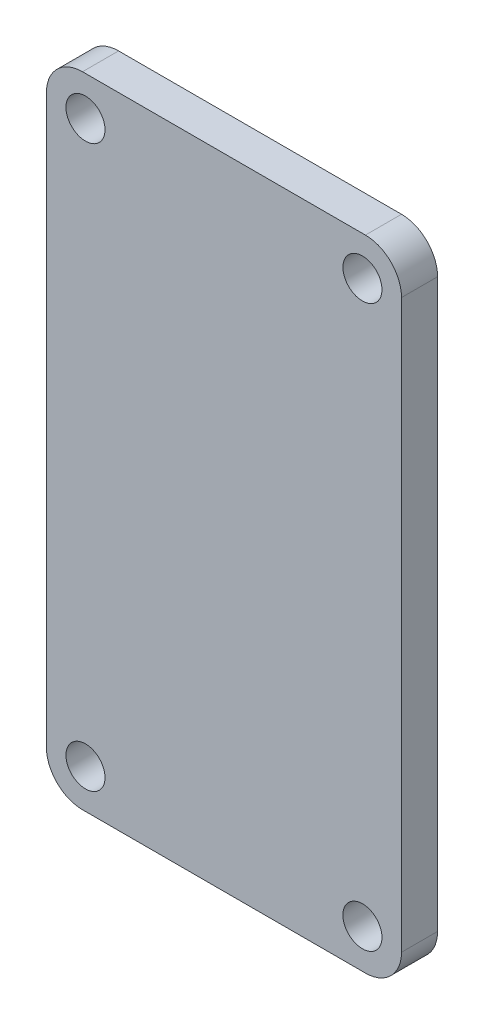
ISO-10303-21;
HEADER;
FILE_DESCRIPTION(('STEP AP214'),'2;1');
FILE_NAME('part.step','',(''),(''),'','','');
FILE_SCHEMA(('AUTOMOTIVE_DESIGN { 1 0 10303 214 1 1 1 1 }'));
ENDSEC;
DATA;
#1=APPLICATION_CONTEXT('core data for automotive mechanical design processes');
#2=APPLICATION_PROTOCOL_DEFINITION('international standard','automotive_design',2000,#1);
#3=PRODUCT_CONTEXT('',#1,'mechanical');
#4=PRODUCT('Part','Part','',(#3));
#5=PRODUCT_RELATED_PRODUCT_CATEGORY('part','',(#4));
#6=PRODUCT_DEFINITION_FORMATION('','',#4);
#7=PRODUCT_DEFINITION_CONTEXT('part definition',#1,'design');
#8=PRODUCT_DEFINITION('design','',#6,#7);
#9=PRODUCT_DEFINITION_SHAPE('','',#8);
#10=(LENGTH_UNIT() NAMED_UNIT(*) SI_UNIT(.MILLI.,.METRE.));
#11=(NAMED_UNIT(*) PLANE_ANGLE_UNIT() SI_UNIT($,.RADIAN.));
#12=(NAMED_UNIT(*) SI_UNIT($,.STERADIAN.) SOLID_ANGLE_UNIT());
#13=UNCERTAINTY_MEASURE_WITH_UNIT(LENGTH_MEASURE(1.E-05),#10,'distance_accuracy_value','');
#14=(GEOMETRIC_REPRESENTATION_CONTEXT(3) GLOBAL_UNCERTAINTY_ASSIGNED_CONTEXT((#13)) GLOBAL_UNIT_ASSIGNED_CONTEXT((#10,
#11,#12)) REPRESENTATION_CONTEXT('',''));
#15=CARTESIAN_POINT('',(0.,0.,0.));
#16=DIRECTION('',(0.,0.,1.));
#17=DIRECTION('',(1.,0.,0.));
#18=AXIS2_PLACEMENT_3D('',#15,#16,#17);
#19=CARTESIAN_POINT('',(0.,0.,2.54));
#20=DIRECTION('',(0.,0.,1.));
#21=DIRECTION('',(1.,0.,0.));
#22=AXIS2_PLACEMENT_3D('',#19,#20,#21);
#23=PLANE('',#22);
#24=CARTESIAN_POINT('',(22.25,-42.25,2.54));
#25=DIRECTION('',(0.,0.,1.));
#26=DIRECTION('',(1.,0.,0.));
#27=AXIS2_PLACEMENT_3D('',#24,#25,#26);
#28=CIRCLE('',#27,1.375);
#29=CARTESIAN_POINT('',(23.625,-42.25,2.54));
#30=VERTEX_POINT('',#29);
#31=EDGE_CURVE('E193',#30,#30,#28,.T.);
#32=ORIENTED_EDGE('',*,*,#31,.F.);
#33=EDGE_LOOP('',(#32));
#34=FACE_BOUND('',#33,.T.);
#35=CARTESIAN_POINT('',(2.75,-2.75,2.54));
#36=DIRECTION('',(0.,0.,1.));
#37=DIRECTION('',(1.,0.,0.));
#38=AXIS2_PLACEMENT_3D('',#35,#36,#37);
#39=CIRCLE('',#38,1.375);
#40=CARTESIAN_POINT('',(4.125,-2.75,2.54));
#41=VERTEX_POINT('',#40);
#42=EDGE_CURVE('E176',#41,#41,#39,.T.);
#43=ORIENTED_EDGE('',*,*,#42,.F.);
#44=EDGE_LOOP('',(#43));
#45=FACE_BOUND('',#44,.T.);
#46=DIRECTION('',(0.,1.,0.));
#47=VECTOR('',#46,1.);
#48=CARTESIAN_POINT('',(25.,0.,2.54));
#49=LINE('',#48,#47);
#50=CARTESIAN_POINT('',(25.,-42.46,2.54));
#51=VERTEX_POINT('',#50);
#52=CARTESIAN_POINT('',(25.,-2.54,2.54));
#53=VERTEX_POINT('',#52);
#54=EDGE_CURVE('E183',#51,#53,#49,.T.);
#55=ORIENTED_EDGE('',*,*,#54,.T.);
#56=CARTESIAN_POINT('',(22.46,-2.54,2.54));
#57=DIRECTION('',(0.,0.,1.));
#58=DIRECTION('',(1.,0.,0.));
#59=AXIS2_PLACEMENT_3D('',#56,#57,#58);
#60=CIRCLE('',#59,2.54);
#61=CARTESIAN_POINT('',(22.46,0.,2.54));
#62=VERTEX_POINT('',#61);
#63=EDGE_CURVE('E160',#53,#62,#60,.T.);
#64=ORIENTED_EDGE('',*,*,#63,.T.);
#65=DIRECTION('',(-1.,0.,0.));
#66=VECTOR('',#65,1.);
#67=CARTESIAN_POINT('',(0.,0.,2.54));
#68=LINE('',#67,#66);
#69=CARTESIAN_POINT('',(2.54,0.,2.54));
#70=VERTEX_POINT('',#69);
#71=EDGE_CURVE('E131',#62,#70,#68,.T.);
#72=ORIENTED_EDGE('',*,*,#71,.T.);
#73=CARTESIAN_POINT('',(2.54,-2.54,2.54));
#74=DIRECTION('',(0.,0.,1.));
#75=DIRECTION('',(1.,0.,0.));
#76=AXIS2_PLACEMENT_3D('',#73,#74,#75);
#77=CIRCLE('',#76,2.54);
#78=CARTESIAN_POINT('',(0.,-2.54,2.54));
#79=VERTEX_POINT('',#78);
#80=EDGE_CURVE('E155',#70,#79,#77,.T.);
#81=ORIENTED_EDGE('',*,*,#80,.T.);
#82=DIRECTION('',(0.,-1.,0.));
#83=VECTOR('',#82,1.);
#84=CARTESIAN_POINT('',(0.,0.,2.54));
#85=LINE('',#84,#83);
#86=CARTESIAN_POINT('',(0.,-42.46,2.54));
#87=VERTEX_POINT('',#86);
#88=EDGE_CURVE('E138',#79,#87,#85,.T.);
#89=ORIENTED_EDGE('',*,*,#88,.T.);
#90=CARTESIAN_POINT('',(2.54000000000001,-42.46,2.54));
#91=DIRECTION('',(0.,0.,1.));
#92=DIRECTION('',(1.,0.,0.));
#93=AXIS2_PLACEMENT_3D('',#90,#91,#92);
#94=CIRCLE('',#93,2.54);
#95=CARTESIAN_POINT('',(2.54000000000001,-45.,2.54));
#96=VERTEX_POINT('',#95);
#97=EDGE_CURVE('E67',#87,#96,#94,.T.);
#98=ORIENTED_EDGE('',*,*,#97,.T.);
#99=DIRECTION('',(1.,0.,0.));
#100=VECTOR('',#99,1.);
#101=CARTESIAN_POINT('',(0.,-45.,2.54));
#102=LINE('',#101,#100);
#103=CARTESIAN_POINT('',(22.46,-45.,2.54));
#104=VERTEX_POINT('',#103);
#105=EDGE_CURVE('E141',#96,#104,#102,.T.);
#106=ORIENTED_EDGE('',*,*,#105,.T.);
#107=CARTESIAN_POINT('',(22.46,-42.46,2.54));
#108=DIRECTION('',(0.,0.,1.));
#109=DIRECTION('',(1.,0.,0.));
#110=AXIS2_PLACEMENT_3D('',#107,#108,#109);
#111=CIRCLE('',#110,2.54);
#112=EDGE_CURVE('E158',#104,#51,#111,.T.);
#113=ORIENTED_EDGE('',*,*,#112,.T.);
#114=EDGE_LOOP('',(#55,#64,#72,#81,#89,#98,#106,#113));
#115=FACE_BOUND('',#114,.T.);
#116=CARTESIAN_POINT('',(2.75,-42.25,2.54));
#117=DIRECTION('',(0.,0.,1.));
#118=DIRECTION('',(-1.,0.,0.));
#119=AXIS2_PLACEMENT_3D('',#116,#117,#118);
#120=CIRCLE('',#119,1.375);
#121=CARTESIAN_POINT('',(1.375,-42.25,2.54));
#122=VERTEX_POINT('',#121);
#123=EDGE_CURVE('E188',#122,#122,#120,.T.);
#124=ORIENTED_EDGE('',*,*,#123,.F.);
#125=EDGE_LOOP('',(#124));
#126=FACE_BOUND('',#125,.T.);
#127=CARTESIAN_POINT('',(22.25,-2.75,2.54));
#128=DIRECTION('',(0.,0.,1.));
#129=DIRECTION('',(-1.,0.,0.));
#130=AXIS2_PLACEMENT_3D('',#127,#128,#129);
#131=CIRCLE('',#130,1.375);
#132=CARTESIAN_POINT('',(20.875,-2.75,2.54));
#133=VERTEX_POINT('',#132);
#134=EDGE_CURVE('E199',#133,#133,#131,.T.);
#135=ORIENTED_EDGE('',*,*,#134,.F.);
#136=EDGE_LOOP('',(#135));
#137=FACE_BOUND('',#136,.T.);
#138=ADVANCED_FACE('F45',(#34,#45,#115,#126,#137),#23,.T.);
#139=CARTESIAN_POINT('',(0.,0.,0.));
#140=DIRECTION('',(0.,0.,1.));
#141=DIRECTION('',(1.,0.,0.));
#142=AXIS2_PLACEMENT_3D('',#139,#140,#141);
#143=PLANE('',#142);
#144=DIRECTION('',(-1.,0.,0.));
#145=VECTOR('',#144,1.);
#146=CARTESIAN_POINT('',(0.,0.,0.));
#147=LINE('',#146,#145);
#148=CARTESIAN_POINT('',(22.46,0.,0.));
#149=VERTEX_POINT('',#148);
#150=CARTESIAN_POINT('',(2.54,0.,0.));
#151=VERTEX_POINT('',#150);
#152=EDGE_CURVE('E128',#149,#151,#147,.T.);
#153=ORIENTED_EDGE('',*,*,#152,.F.);
#154=CARTESIAN_POINT('',(22.46,-2.54,0.));
#155=DIRECTION('',(0.,0.,1.));
#156=DIRECTION('',(1.,0.,0.));
#157=AXIS2_PLACEMENT_3D('',#154,#155,#156);
#158=CIRCLE('',#157,2.54);
#159=CARTESIAN_POINT('',(25.,-2.54,0.));
#160=VERTEX_POINT('',#159);
#161=EDGE_CURVE('E111',#149,#160,#158,.F.);
#162=ORIENTED_EDGE('',*,*,#161,.T.);
#163=DIRECTION('',(0.,1.,0.));
#164=VECTOR('',#163,1.);
#165=CARTESIAN_POINT('',(25.,0.,0.));
#166=LINE('',#165,#164);
#167=CARTESIAN_POINT('',(25.,-42.46,0.));
#168=VERTEX_POINT('',#167);
#169=EDGE_CURVE('E139',#168,#160,#166,.T.);
#170=ORIENTED_EDGE('',*,*,#169,.F.);
#171=CARTESIAN_POINT('',(22.46,-42.46,0.));
#172=DIRECTION('',(0.,0.,1.));
#173=DIRECTION('',(1.,0.,0.));
#174=AXIS2_PLACEMENT_3D('',#171,#172,#173);
#175=CIRCLE('',#174,2.54);
#176=CARTESIAN_POINT('',(22.46,-45.,0.));
#177=VERTEX_POINT('',#176);
#178=EDGE_CURVE('E122',#168,#177,#175,.F.);
#179=ORIENTED_EDGE('',*,*,#178,.T.);
#180=DIRECTION('',(1.,0.,0.));
#181=VECTOR('',#180,1.);
#182=CARTESIAN_POINT('',(0.,-45.,0.));
#183=LINE('',#182,#181);
#184=CARTESIAN_POINT('',(2.54000000000001,-45.,0.));
#185=VERTEX_POINT('',#184);
#186=EDGE_CURVE('E143',#185,#177,#183,.T.);
#187=ORIENTED_EDGE('',*,*,#186,.F.);
#188=CARTESIAN_POINT('',(2.54000000000001,-42.46,0.));
#189=DIRECTION('',(0.,0.,1.));
#190=DIRECTION('',(1.,0.,0.));
#191=AXIS2_PLACEMENT_3D('',#188,#189,#190);
#192=CIRCLE('',#191,2.54);
#193=CARTESIAN_POINT('',(0.,-42.46,0.));
#194=VERTEX_POINT('',#193);
#195=EDGE_CURVE('E149',#185,#194,#192,.F.);
#196=ORIENTED_EDGE('',*,*,#195,.T.);
#197=DIRECTION('',(0.,-1.,0.));
#198=VECTOR('',#197,1.);
#199=CARTESIAN_POINT('',(0.,0.,0.));
#200=LINE('',#199,#198);
#201=CARTESIAN_POINT('',(0.,-2.54,0.));
#202=VERTEX_POINT('',#201);
#203=EDGE_CURVE('E171',#202,#194,#200,.T.);
#204=ORIENTED_EDGE('',*,*,#203,.F.);
#205=CARTESIAN_POINT('',(2.54,-2.54,0.));
#206=DIRECTION('',(0.,0.,1.));
#207=DIRECTION('',(1.,0.,0.));
#208=AXIS2_PLACEMENT_3D('',#205,#206,#207);
#209=CIRCLE('',#208,2.54);
#210=EDGE_CURVE('E132',#202,#151,#209,.F.);
#211=ORIENTED_EDGE('',*,*,#210,.T.);
#212=EDGE_LOOP('',(#153,#162,#170,#179,#187,#196,#204,#211));
#213=FACE_BOUND('',#212,.T.);
#214=CARTESIAN_POINT('',(2.75,-2.75,0.));
#215=DIRECTION('',(0.,0.,1.));
#216=DIRECTION('',(1.,0.,0.));
#217=AXIS2_PLACEMENT_3D('',#214,#215,#216);
#218=CIRCLE('',#217,1.375);
#219=CARTESIAN_POINT('',(4.125,-2.75,0.));
#220=VERTEX_POINT('',#219);
#221=EDGE_CURVE('E179',#220,#220,#218,.T.);
#222=ORIENTED_EDGE('',*,*,#221,.T.);
#223=EDGE_LOOP('',(#222));
#224=FACE_BOUND('',#223,.T.);
#225=CARTESIAN_POINT('',(2.75,-42.25,0.));
#226=DIRECTION('',(0.,0.,1.));
#227=DIRECTION('',(-1.,0.,0.));
#228=AXIS2_PLACEMENT_3D('',#225,#226,#227);
#229=CIRCLE('',#228,1.375);
#230=CARTESIAN_POINT('',(1.375,-42.25,0.));
#231=VERTEX_POINT('',#230);
#232=EDGE_CURVE('E190',#231,#231,#229,.T.);
#233=ORIENTED_EDGE('',*,*,#232,.T.);
#234=EDGE_LOOP('',(#233));
#235=FACE_BOUND('',#234,.T.);
#236=CARTESIAN_POINT('',(22.25,-42.25,0.));
#237=DIRECTION('',(0.,0.,1.));
#238=DIRECTION('',(1.,0.,0.));
#239=AXIS2_PLACEMENT_3D('',#236,#237,#238);
#240=CIRCLE('',#239,1.375);
#241=CARTESIAN_POINT('',(23.625,-42.25,0.));
#242=VERTEX_POINT('',#241);
#243=EDGE_CURVE('E196',#242,#242,#240,.T.);
#244=ORIENTED_EDGE('',*,*,#243,.T.);
#245=EDGE_LOOP('',(#244));
#246=FACE_BOUND('',#245,.T.);
#247=CARTESIAN_POINT('',(22.25,-2.75,0.));
#248=DIRECTION('',(0.,0.,1.));
#249=DIRECTION('',(-1.,0.,0.));
#250=AXIS2_PLACEMENT_3D('',#247,#248,#249);
#251=CIRCLE('',#250,1.375);
#252=CARTESIAN_POINT('',(20.875,-2.75,0.));
#253=VERTEX_POINT('',#252);
#254=EDGE_CURVE('E202',#253,#253,#251,.T.);
#255=ORIENTED_EDGE('',*,*,#254,.T.);
#256=EDGE_LOOP('',(#255));
#257=FACE_BOUND('',#256,.T.);
#258=ADVANCED_FACE('F135',(#213,#224,#235,#246,#257),#143,.F.);
#259=CARTESIAN_POINT('',(0.,0.,2.54));
#260=DIRECTION('',(1.,0.,0.));
#261=DIRECTION('',(0.,1.,0.));
#262=AXIS2_PLACEMENT_3D('',#259,#260,#261);
#263=PLANE('',#262);
#264=ORIENTED_EDGE('',*,*,#203,.T.);
#265=DIRECTION('',(0.,0.,-1.));
#266=VECTOR('',#265,1.);
#267=CARTESIAN_POINT('',(0.,-42.46,2.54));
#268=LINE('',#267,#266);
#269=EDGE_CURVE('E11',#194,#87,#268,.F.);
#270=ORIENTED_EDGE('',*,*,#269,.T.);
#271=ORIENTED_EDGE('',*,*,#88,.F.);
#272=DIRECTION('',(0.,0.,-1.));
#273=VECTOR('',#272,1.);
#274=CARTESIAN_POINT('',(0.,-2.54,2.54));
#275=LINE('',#274,#273);
#276=EDGE_CURVE('E53',#79,#202,#275,.T.);
#277=ORIENTED_EDGE('',*,*,#276,.T.);
#278=EDGE_LOOP('',(#264,#270,#271,#277));
#279=FACE_BOUND('',#278,.T.);
#280=ADVANCED_FACE('F170',(#279),#263,.F.);
#281=CARTESIAN_POINT('',(0.,-45.,2.54));
#282=DIRECTION('',(0.,1.,0.));
#283=DIRECTION('',(0.,0.,1.));
#284=AXIS2_PLACEMENT_3D('',#281,#282,#283);
#285=PLANE('',#284);
#286=ORIENTED_EDGE('',*,*,#186,.T.);
#287=DIRECTION('',(0.,0.,-1.));
#288=VECTOR('',#287,1.);
#289=CARTESIAN_POINT('',(22.46,-45.,2.54));
#290=LINE('',#289,#288);
#291=EDGE_CURVE('E60',#177,#104,#290,.F.);
#292=ORIENTED_EDGE('',*,*,#291,.T.);
#293=ORIENTED_EDGE('',*,*,#105,.F.);
#294=DIRECTION('',(0.,0.,-1.));
#295=VECTOR('',#294,1.);
#296=CARTESIAN_POINT('',(2.54000000000001,-45.,2.54));
#297=LINE('',#296,#295);
#298=EDGE_CURVE('E162',#96,#185,#297,.T.);
#299=ORIENTED_EDGE('',*,*,#298,.T.);
#300=EDGE_LOOP('',(#286,#292,#293,#299));
#301=FACE_BOUND('',#300,.T.);
#302=ADVANCED_FACE('F230',(#301),#285,.F.);
#303=CARTESIAN_POINT('',(25.,0.,2.54));
#304=DIRECTION('',(-1.,0.,0.));
#305=DIRECTION('',(0.,-1.,0.));
#306=AXIS2_PLACEMENT_3D('',#303,#304,#305);
#307=PLANE('',#306);
#308=ORIENTED_EDGE('',*,*,#169,.T.);
#309=DIRECTION('',(0.,0.,-1.));
#310=VECTOR('',#309,1.);
#311=CARTESIAN_POINT('',(25.,-2.54,2.54));
#312=LINE('',#311,#310);
#313=EDGE_CURVE('E116',#160,#53,#312,.F.);
#314=ORIENTED_EDGE('',*,*,#313,.T.);
#315=ORIENTED_EDGE('',*,*,#54,.F.);
#316=DIRECTION('',(0.,0.,-1.));
#317=VECTOR('',#316,1.);
#318=CARTESIAN_POINT('',(25.,-42.46,2.54));
#319=LINE('',#318,#317);
#320=EDGE_CURVE('E121',#51,#168,#319,.T.);
#321=ORIENTED_EDGE('',*,*,#320,.T.);
#322=EDGE_LOOP('',(#308,#314,#315,#321));
#323=FACE_BOUND('',#322,.T.);
#324=ADVANCED_FACE('F227',(#323),#307,.F.);
#325=CARTESIAN_POINT('',(0.,0.,2.54));
#326=DIRECTION('',(0.,-1.,0.));
#327=DIRECTION('',(0.,0.,-1.));
#328=AXIS2_PLACEMENT_3D('',#325,#326,#327);
#329=PLANE('',#328);
#330=ORIENTED_EDGE('',*,*,#71,.F.);
#331=DIRECTION('',(0.,0.,-1.));
#332=VECTOR('',#331,1.);
#333=CARTESIAN_POINT('',(22.46,0.,2.54));
#334=LINE('',#333,#332);
#335=EDGE_CURVE('E115',#62,#149,#334,.T.);
#336=ORIENTED_EDGE('',*,*,#335,.T.);
#337=ORIENTED_EDGE('',*,*,#152,.T.);
#338=DIRECTION('',(0.,0.,-1.));
#339=VECTOR('',#338,1.);
#340=CARTESIAN_POINT('',(2.54,0.,2.54));
#341=LINE('',#340,#339);
#342=EDGE_CURVE('E133',#151,#70,#341,.F.);
#343=ORIENTED_EDGE('',*,*,#342,.T.);
#344=EDGE_LOOP('',(#330,#336,#337,#343));
#345=FACE_BOUND('',#344,.T.);
#346=ADVANCED_FACE('F127',(#345),#329,.F.);
#347=CARTESIAN_POINT('',(2.75,-2.75,2.54));
#348=DIRECTION('',(0.,0.,-1.));
#349=DIRECTION('',(-1.,0.,0.));
#350=AXIS2_PLACEMENT_3D('',#347,#348,#349);
#351=CYLINDRICAL_SURFACE('',#350,1.375);
#352=ORIENTED_EDGE('',*,*,#42,.T.);
#353=EDGE_LOOP('',(#352));
#354=FACE_BOUND('',#353,.T.);
#355=ORIENTED_EDGE('',*,*,#221,.F.);
#356=EDGE_LOOP('',(#355));
#357=FACE_BOUND('',#356,.T.);
#358=ADVANCED_FACE('F222',(#354,#357),#351,.F.);
#359=CARTESIAN_POINT('',(2.75,-42.25,2.54));
#360=DIRECTION('',(0.,0.,-1.));
#361=DIRECTION('',(-1.,0.,0.));
#362=AXIS2_PLACEMENT_3D('',#359,#360,#361);
#363=CYLINDRICAL_SURFACE('',#362,1.375);
#364=ORIENTED_EDGE('',*,*,#123,.T.);
#365=EDGE_LOOP('',(#364));
#366=FACE_BOUND('',#365,.T.);
#367=ORIENTED_EDGE('',*,*,#232,.F.);
#368=EDGE_LOOP('',(#367));
#369=FACE_BOUND('',#368,.T.);
#370=ADVANCED_FACE('F254',(#366,#369),#363,.F.);
#371=CARTESIAN_POINT('',(22.25,-42.25,2.54));
#372=DIRECTION('',(0.,0.,-1.));
#373=DIRECTION('',(-1.,0.,0.));
#374=AXIS2_PLACEMENT_3D('',#371,#372,#373);
#375=CYLINDRICAL_SURFACE('',#374,1.375);
#376=ORIENTED_EDGE('',*,*,#31,.T.);
#377=EDGE_LOOP('',(#376));
#378=FACE_BOUND('',#377,.T.);
#379=ORIENTED_EDGE('',*,*,#243,.F.);
#380=EDGE_LOOP('',(#379));
#381=FACE_BOUND('',#380,.T.);
#382=ADVANCED_FACE('F257',(#378,#381),#375,.F.);
#383=CARTESIAN_POINT('',(22.25,-2.75,2.54));
#384=DIRECTION('',(0.,0.,-1.));
#385=DIRECTION('',(-1.,0.,0.));
#386=AXIS2_PLACEMENT_3D('',#383,#384,#385);
#387=CYLINDRICAL_SURFACE('',#386,1.375);
#388=ORIENTED_EDGE('',*,*,#134,.T.);
#389=EDGE_LOOP('',(#388));
#390=FACE_BOUND('',#389,.T.);
#391=ORIENTED_EDGE('',*,*,#254,.F.);
#392=EDGE_LOOP('',(#391));
#393=FACE_BOUND('',#392,.T.);
#394=ADVANCED_FACE('F208',(#390,#393),#387,.F.);
#395=CARTESIAN_POINT('',(22.46,-2.54,2.54));
#396=DIRECTION('',(0.,0.,-1.));
#397=DIRECTION('',(-1.,0.,0.));
#398=AXIS2_PLACEMENT_3D('',#395,#396,#397);
#399=CYLINDRICAL_SURFACE('',#398,2.54);
#400=ORIENTED_EDGE('',*,*,#63,.F.);
#401=ORIENTED_EDGE('',*,*,#313,.F.);
#402=ORIENTED_EDGE('',*,*,#161,.F.);
#403=ORIENTED_EDGE('',*,*,#335,.F.);
#404=EDGE_LOOP('',(#400,#401,#402,#403));
#405=FACE_BOUND('',#404,.T.);
#406=ADVANCED_FACE('F114',(#405),#399,.T.);
#407=CARTESIAN_POINT('',(22.46,-42.46,2.54));
#408=DIRECTION('',(0.,0.,-1.));
#409=DIRECTION('',(-1.,0.,0.));
#410=AXIS2_PLACEMENT_3D('',#407,#408,#409);
#411=CYLINDRICAL_SURFACE('',#410,2.54);
#412=ORIENTED_EDGE('',*,*,#112,.F.);
#413=ORIENTED_EDGE('',*,*,#291,.F.);
#414=ORIENTED_EDGE('',*,*,#178,.F.);
#415=ORIENTED_EDGE('',*,*,#320,.F.);
#416=EDGE_LOOP('',(#412,#413,#414,#415));
#417=FACE_BOUND('',#416,.T.);
#418=ADVANCED_FACE('F238',(#417),#411,.T.);
#419=CARTESIAN_POINT('',(2.54000000000001,-42.46,2.54));
#420=DIRECTION('',(0.,0.,-1.));
#421=DIRECTION('',(-1.,0.,0.));
#422=AXIS2_PLACEMENT_3D('',#419,#420,#421);
#423=CYLINDRICAL_SURFACE('',#422,2.54);
#424=ORIENTED_EDGE('',*,*,#97,.F.);
#425=ORIENTED_EDGE('',*,*,#269,.F.);
#426=ORIENTED_EDGE('',*,*,#195,.F.);
#427=ORIENTED_EDGE('',*,*,#298,.F.);
#428=EDGE_LOOP('',(#424,#425,#426,#427));
#429=FACE_BOUND('',#428,.T.);
#430=ADVANCED_FACE('F240',(#429),#423,.T.);
#431=CARTESIAN_POINT('',(2.54,-2.54,2.54));
#432=DIRECTION('',(0.,0.,-1.));
#433=DIRECTION('',(-1.,0.,0.));
#434=AXIS2_PLACEMENT_3D('',#431,#432,#433);
#435=CYLINDRICAL_SURFACE('',#434,2.54);
#436=ORIENTED_EDGE('',*,*,#80,.F.);
#437=ORIENTED_EDGE('',*,*,#342,.F.);
#438=ORIENTED_EDGE('',*,*,#210,.F.);
#439=ORIENTED_EDGE('',*,*,#276,.F.);
#440=EDGE_LOOP('',(#436,#437,#438,#439));
#441=FACE_BOUND('',#440,.T.);
#442=ADVANCED_FACE('F47',(#441),#435,.T.);
#443=CLOSED_SHELL('',(#138,#258,#280,#302,#324,#346,#358,#370,#382,#394,#406,#418,#430,#442));
#444=MANIFOLD_SOLID_BREP('B2',#443);
#445=ADVANCED_BREP_SHAPE_REPRESENTATION('',(#18,#444),#14);
#446=SHAPE_DEFINITION_REPRESENTATION(#9,#445);
ENDSEC;
END-ISO-10303-21;
